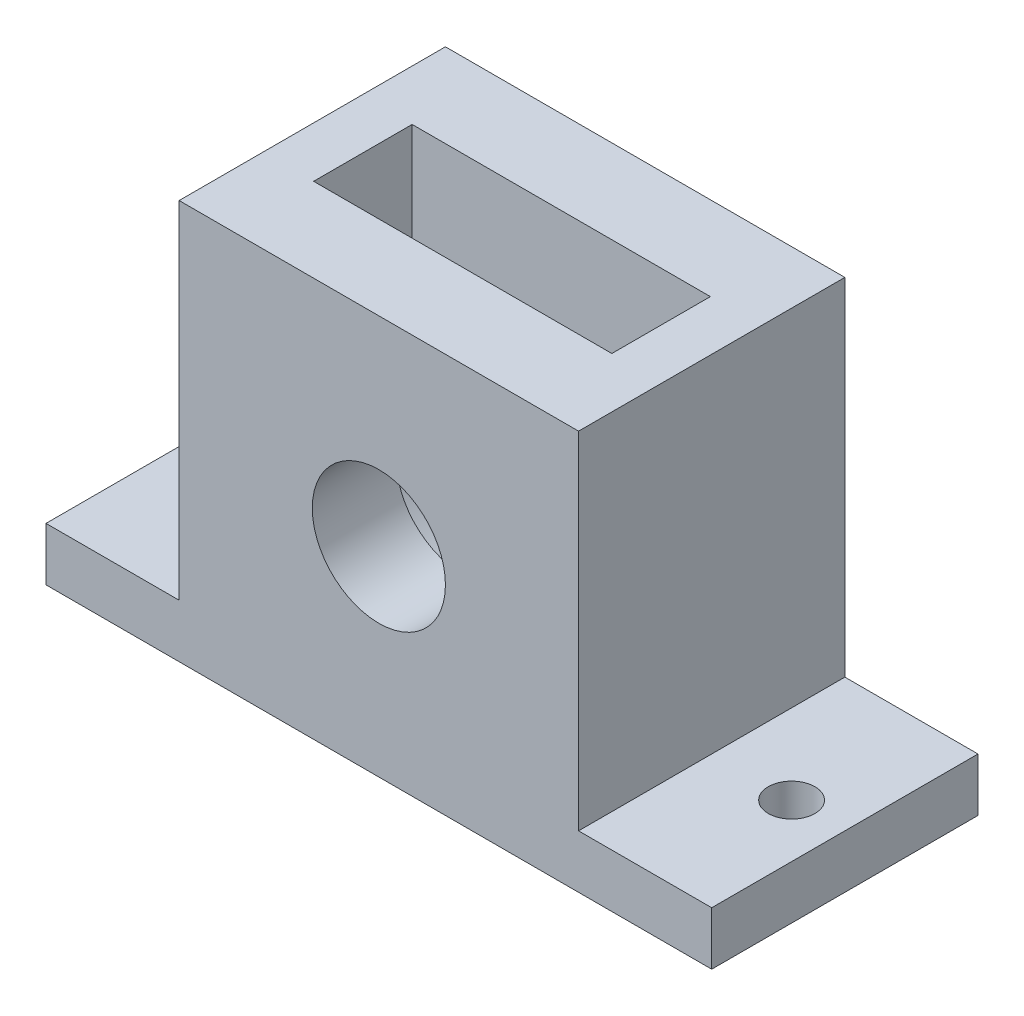
ISO-10303-21;
HEADER;
FILE_DESCRIPTION(('STEP AP214'),'2;1');
FILE_NAME('part.step','',(''),(''),'','','');
FILE_SCHEMA(('AUTOMOTIVE_DESIGN { 1 0 10303 214 1 1 1 1 }'));
ENDSEC;
DATA;
#1=APPLICATION_CONTEXT('core data for automotive mechanical design processes');
#2=APPLICATION_PROTOCOL_DEFINITION('international standard','automotive_design',2000,#1);
#3=PRODUCT_CONTEXT('',#1,'mechanical');
#4=PRODUCT('Part','Part','',(#3));
#5=PRODUCT_RELATED_PRODUCT_CATEGORY('part','',(#4));
#6=PRODUCT_DEFINITION_FORMATION('','',#4);
#7=PRODUCT_DEFINITION_CONTEXT('part definition',#1,'design');
#8=PRODUCT_DEFINITION('design','',#6,#7);
#9=PRODUCT_DEFINITION_SHAPE('','',#8);
#10=(LENGTH_UNIT() NAMED_UNIT(*) SI_UNIT(.MILLI.,.METRE.));
#11=(NAMED_UNIT(*) PLANE_ANGLE_UNIT() SI_UNIT($,.RADIAN.));
#12=(NAMED_UNIT(*) SI_UNIT($,.STERADIAN.) SOLID_ANGLE_UNIT());
#13=UNCERTAINTY_MEASURE_WITH_UNIT(LENGTH_MEASURE(1.E-05),#10,'distance_accuracy_value','');
#14=(GEOMETRIC_REPRESENTATION_CONTEXT(3) GLOBAL_UNCERTAINTY_ASSIGNED_CONTEXT((#13)) GLOBAL_UNIT_ASSIGNED_CONTEXT((#10,
#11,#12)) REPRESENTATION_CONTEXT('',''));
#15=CARTESIAN_POINT('',(0.,0.,0.));
#16=DIRECTION('',(0.,0.,1.));
#17=DIRECTION('',(1.,0.,0.));
#18=AXIS2_PLACEMENT_3D('',#15,#16,#17);
#19=CARTESIAN_POINT('',(15.,-15.,20.));
#20=DIRECTION('',(-1.,0.,0.));
#21=DIRECTION('',(0.,0.,1.));
#22=AXIS2_PLACEMENT_3D('',#19,#20,#21);
#23=PLANE('',#22);
#24=DIRECTION('',(0.,0.,1.));
#25=VECTOR('',#24,1.);
#26=CARTESIAN_POINT('',(15.,-11.,0.));
#27=LINE('',#26,#25);
#28=CARTESIAN_POINT('',(15.,-11.,0.));
#29=VERTEX_POINT('',#28);
#30=CARTESIAN_POINT('',(15.,-11.,20.));
#31=VERTEX_POINT('',#30);
#32=EDGE_CURVE('E62',#29,#31,#27,.T.);
#33=ORIENTED_EDGE('',*,*,#32,.F.);
#34=DIRECTION('',(0.,1.,0.));
#35=VECTOR('',#34,1.);
#36=CARTESIAN_POINT('',(15.,-15.,0.));
#37=LINE('',#36,#35);
#38=CARTESIAN_POINT('',(15.,15.,0.));
#39=VERTEX_POINT('',#38);
#40=EDGE_CURVE('E261',#29,#39,#37,.T.);
#41=ORIENTED_EDGE('',*,*,#40,.T.);
#42=DIRECTION('',(0.,0.,-1.));
#43=VECTOR('',#42,1.);
#44=CARTESIAN_POINT('',(15.,15.,20.));
#45=LINE('',#44,#43);
#46=CARTESIAN_POINT('',(15.,15.,20.));
#47=VERTEX_POINT('',#46);
#48=EDGE_CURVE('E11',#47,#39,#45,.T.);
#49=ORIENTED_EDGE('',*,*,#48,.F.);
#50=DIRECTION('',(0.,1.,0.));
#51=VECTOR('',#50,1.);
#52=CARTESIAN_POINT('',(15.,-15.,20.));
#53=LINE('',#52,#51);
#54=EDGE_CURVE('E266',#31,#47,#53,.T.);
#55=ORIENTED_EDGE('',*,*,#54,.F.);
#56=EDGE_LOOP('',(#33,#41,#49,#55));
#57=FACE_BOUND('',#56,.T.);
#58=ADVANCED_FACE('F45',(#57),#23,.F.);
#59=CARTESIAN_POINT('',(-15.,-15.,20.));
#60=DIRECTION('',(1.,0.,0.));
#61=DIRECTION('',(0.,0.,-1.));
#62=AXIS2_PLACEMENT_3D('',#59,#60,#61);
#63=PLANE('',#62);
#64=DIRECTION('',(0.,0.,-1.));
#65=VECTOR('',#64,1.);
#66=CARTESIAN_POINT('',(-15.,-11.,0.));
#67=LINE('',#66,#65);
#68=CARTESIAN_POINT('',(-15.,-11.,20.));
#69=VERTEX_POINT('',#68);
#70=CARTESIAN_POINT('',(-15.,-11.,0.));
#71=VERTEX_POINT('',#70);
#72=EDGE_CURVE('E70',#69,#71,#67,.T.);
#73=ORIENTED_EDGE('',*,*,#72,.F.);
#74=DIRECTION('',(0.,-1.,0.));
#75=VECTOR('',#74,1.);
#76=CARTESIAN_POINT('',(-15.,-15.,20.));
#77=LINE('',#76,#75);
#78=CARTESIAN_POINT('',(-15.,15.,20.));
#79=VERTEX_POINT('',#78);
#80=EDGE_CURVE('E161',#79,#69,#77,.T.);
#81=ORIENTED_EDGE('',*,*,#80,.F.);
#82=DIRECTION('',(0.,0.,-1.));
#83=VECTOR('',#82,1.);
#84=CARTESIAN_POINT('',(-15.,15.,20.));
#85=LINE('',#84,#83);
#86=CARTESIAN_POINT('',(-15.,15.,0.));
#87=VERTEX_POINT('',#86);
#88=EDGE_CURVE('E54',#79,#87,#85,.T.);
#89=ORIENTED_EDGE('',*,*,#88,.T.);
#90=DIRECTION('',(0.,-1.,0.));
#91=VECTOR('',#90,1.);
#92=CARTESIAN_POINT('',(-15.,-15.,0.));
#93=LINE('',#92,#91);
#94=EDGE_CURVE('E283',#87,#71,#93,.T.);
#95=ORIENTED_EDGE('',*,*,#94,.T.);
#96=EDGE_LOOP('',(#73,#81,#89,#95));
#97=FACE_BOUND('',#96,.T.);
#98=ADVANCED_FACE('F335',(#97),#63,.F.);
#99=CARTESIAN_POINT('',(-15.,15.,20.));
#100=DIRECTION('',(0.,-1.,0.));
#101=DIRECTION('',(0.,0.,-1.));
#102=AXIS2_PLACEMENT_3D('',#99,#100,#101);
#103=PLANE('',#102);
#104=DIRECTION('',(-1.,0.,0.));
#105=VECTOR('',#104,1.);
#106=CARTESIAN_POINT('',(-15.,15.,0.));
#107=LINE('',#106,#105);
#108=EDGE_CURVE('E280',#39,#87,#107,.T.);
#109=ORIENTED_EDGE('',*,*,#108,.T.);
#110=ORIENTED_EDGE('',*,*,#88,.F.);
#111=DIRECTION('',(-1.,0.,0.));
#112=VECTOR('',#111,1.);
#113=CARTESIAN_POINT('',(-15.,15.,20.));
#114=LINE('',#113,#112);
#115=EDGE_CURVE('E269',#47,#79,#114,.T.);
#116=ORIENTED_EDGE('',*,*,#115,.F.);
#117=ORIENTED_EDGE('',*,*,#48,.T.);
#118=EDGE_LOOP('',(#109,#110,#116,#117));
#119=FACE_BOUND('',#118,.T.);
#120=DIRECTION('',(-1.,0.,0.));
#121=VECTOR('',#120,1.);
#122=CARTESIAN_POINT('',(399997.5,14.9999999999864,13.7));
#123=LINE('',#122,#121);
#124=CARTESIAN_POINT('',(11.1999999999739,14.9999999999864,13.7));
#125=VERTEX_POINT('',#124);
#126=CARTESIAN_POINT('',(-11.1999999999508,14.9999999999864,13.7));
#127=VERTEX_POINT('',#126);
#128=EDGE_CURVE('E218',#125,#127,#123,.T.);
#129=ORIENTED_EDGE('',*,*,#128,.T.);
#130=DIRECTION('',(0.,0.,-1.));
#131=VECTOR('',#130,1.);
#132=CARTESIAN_POINT('',(-11.1999999999508,14.9999999999864,13.7));
#133=LINE('',#132,#131);
#134=CARTESIAN_POINT('',(-11.1999999999508,14.9999999999864,6.3));
#135=VERTEX_POINT('',#134);
#136=EDGE_CURVE('E248',#127,#135,#133,.T.);
#137=ORIENTED_EDGE('',*,*,#136,.T.);
#138=DIRECTION('',(-1.,0.,0.));
#139=VECTOR('',#138,1.);
#140=CARTESIAN_POINT('',(399997.5,14.9999999999864,6.3));
#141=LINE('',#140,#139);
#142=CARTESIAN_POINT('',(11.2,15.,6.3));
#143=VERTEX_POINT('',#142);
#144=EDGE_CURVE('E233',#143,#135,#141,.T.);
#145=ORIENTED_EDGE('',*,*,#144,.F.);
#146=DIRECTION('',(0.,0.,-1.));
#147=VECTOR('',#146,1.);
#148=CARTESIAN_POINT('',(11.1999999999739,14.9999999999864,13.7));
#149=LINE('',#148,#147);
#150=EDGE_CURVE('E252',#125,#143,#149,.T.);
#151=ORIENTED_EDGE('',*,*,#150,.F.);
#152=EDGE_LOOP('',(#129,#137,#145,#151));
#153=FACE_BOUND('',#152,.T.);
#154=ADVANCED_FACE('F321',(#119,#153),#103,.F.);
#155=CARTESIAN_POINT('',(0.,0.,20.));
#156=DIRECTION('',(0.,0.,-1.));
#157=DIRECTION('',(-1.,0.,0.));
#158=AXIS2_PLACEMENT_3D('',#155,#156,#157);
#159=CYLINDRICAL_SURFACE('',#158,5.);
#160=CARTESIAN_POINT('',(0.,0.,20.));
#161=DIRECTION('',(0.,0.,1.));
#162=DIRECTION('',(1.,0.,0.));
#163=AXIS2_PLACEMENT_3D('',#160,#161,#162);
#164=CIRCLE('',#163,5.);
#165=CARTESIAN_POINT('',(5.,0.,20.));
#166=VERTEX_POINT('',#165);
#167=EDGE_CURVE('E257',#166,#166,#164,.T.);
#168=ORIENTED_EDGE('',*,*,#167,.T.);
#169=EDGE_LOOP('',(#168));
#170=FACE_BOUND('',#169,.T.);
#171=CARTESIAN_POINT('',(0.,0.,13.7));
#172=DIRECTION('',(0.,0.,-1.));
#173=DIRECTION('',(-1.,0.,0.));
#174=AXIS2_PLACEMENT_3D('',#171,#172,#173);
#175=CIRCLE('',#174,5.);
#176=CARTESIAN_POINT('',(-5.,0.,13.7));
#177=VERTEX_POINT('',#176);
#178=EDGE_CURVE('E48',#177,#177,#175,.T.);
#179=ORIENTED_EDGE('',*,*,#178,.T.);
#180=EDGE_LOOP('',(#179));
#181=FACE_BOUND('',#180,.T.);
#182=ADVANCED_FACE('F298',(#170,#181),#159,.F.);
#183=CARTESIAN_POINT('',(0.,0.,20.));
#184=DIRECTION('',(0.,0.,-1.));
#185=DIRECTION('',(-1.,0.,0.));
#186=AXIS2_PLACEMENT_3D('',#183,#184,#185);
#187=PLANE('',#186);
#188=DIRECTION('',(1.,0.,0.));
#189=VECTOR('',#188,1.);
#190=CARTESIAN_POINT('',(-15.,-15.,20.));
#191=LINE('',#190,#189);
#192=CARTESIAN_POINT('',(-25.,-15.,20.));
#193=VERTEX_POINT('',#192);
#194=CARTESIAN_POINT('',(25.,-15.,20.));
#195=VERTEX_POINT('',#194);
#196=EDGE_CURVE('E275',#193,#195,#191,.T.);
#197=ORIENTED_EDGE('',*,*,#196,.T.);
#198=DIRECTION('',(0.,-1.,0.));
#199=VECTOR('',#198,1.);
#200=CARTESIAN_POINT('',(25.,-11.,20.));
#201=LINE('',#200,#199);
#202=CARTESIAN_POINT('',(25.,-11.,20.));
#203=VERTEX_POINT('',#202);
#204=EDGE_CURVE('E200',#203,#195,#201,.T.);
#205=ORIENTED_EDGE('',*,*,#204,.F.);
#206=DIRECTION('',(1.,0.,0.));
#207=VECTOR('',#206,1.);
#208=CARTESIAN_POINT('',(0.,-11.,20.));
#209=LINE('',#208,#207);
#210=EDGE_CURVE('E191',#31,#203,#209,.T.);
#211=ORIENTED_EDGE('',*,*,#210,.F.);
#212=ORIENTED_EDGE('',*,*,#54,.T.);
#213=ORIENTED_EDGE('',*,*,#115,.T.);
#214=ORIENTED_EDGE('',*,*,#80,.T.);
#215=DIRECTION('',(-1.,0.,0.));
#216=VECTOR('',#215,1.);
#217=CARTESIAN_POINT('',(0.,-11.,20.));
#218=LINE('',#217,#216);
#219=CARTESIAN_POINT('',(-25.,-11.,20.));
#220=VERTEX_POINT('',#219);
#221=EDGE_CURVE('E153',#69,#220,#218,.T.);
#222=ORIENTED_EDGE('',*,*,#221,.T.);
#223=DIRECTION('',(0.,-1.,0.));
#224=VECTOR('',#223,1.);
#225=CARTESIAN_POINT('',(-25.,-11.,20.));
#226=LINE('',#225,#224);
#227=EDGE_CURVE('E138',#220,#193,#226,.T.);
#228=ORIENTED_EDGE('',*,*,#227,.T.);
#229=EDGE_LOOP('',(#197,#205,#211,#212,#213,#214,#222,#228));
#230=FACE_BOUND('',#229,.T.);
#231=ORIENTED_EDGE('',*,*,#167,.F.);
#232=EDGE_LOOP('',(#231));
#233=FACE_BOUND('',#232,.T.);
#234=ADVANCED_FACE('F159',(#230,#233),#187,.F.);
#235=CARTESIAN_POINT('',(0.,0.,0.));
#236=DIRECTION('',(0.,0.,-1.));
#237=DIRECTION('',(-1.,0.,0.));
#238=AXIS2_PLACEMENT_3D('',#235,#236,#237);
#239=PLANE('',#238);
#240=ORIENTED_EDGE('',*,*,#40,.F.);
#241=DIRECTION('',(1.,0.,0.));
#242=VECTOR('',#241,1.);
#243=CARTESIAN_POINT('',(0.,-11.,0.));
#244=LINE('',#243,#242);
#245=CARTESIAN_POINT('',(25.,-11.,0.));
#246=VERTEX_POINT('',#245);
#247=EDGE_CURVE('E196',#29,#246,#244,.T.);
#248=ORIENTED_EDGE('',*,*,#247,.T.);
#249=DIRECTION('',(0.,-1.,0.));
#250=VECTOR('',#249,1.);
#251=CARTESIAN_POINT('',(25.,-11.,0.));
#252=LINE('',#251,#250);
#253=CARTESIAN_POINT('',(25.,-15.,0.));
#254=VERTEX_POINT('',#253);
#255=EDGE_CURVE('E177',#246,#254,#252,.T.);
#256=ORIENTED_EDGE('',*,*,#255,.T.);
#257=DIRECTION('',(1.,0.,0.));
#258=VECTOR('',#257,1.);
#259=CARTESIAN_POINT('',(-15.,-15.,0.));
#260=LINE('',#259,#258);
#261=CARTESIAN_POINT('',(-25.,-15.,0.));
#262=VERTEX_POINT('',#261);
#263=EDGE_CURVE('E270',#262,#254,#260,.T.);
#264=ORIENTED_EDGE('',*,*,#263,.F.);
#265=DIRECTION('',(0.,-1.,0.));
#266=VECTOR('',#265,1.);
#267=CARTESIAN_POINT('',(-25.,-11.,0.));
#268=LINE('',#267,#266);
#269=CARTESIAN_POINT('',(-25.,-11.,0.));
#270=VERTEX_POINT('',#269);
#271=EDGE_CURVE('E148',#270,#262,#268,.T.);
#272=ORIENTED_EDGE('',*,*,#271,.F.);
#273=DIRECTION('',(-1.,0.,0.));
#274=VECTOR('',#273,1.);
#275=CARTESIAN_POINT('',(0.,-11.,0.));
#276=LINE('',#275,#274);
#277=EDGE_CURVE('E155',#71,#270,#276,.T.);
#278=ORIENTED_EDGE('',*,*,#277,.F.);
#279=ORIENTED_EDGE('',*,*,#94,.F.);
#280=ORIENTED_EDGE('',*,*,#108,.F.);
#281=EDGE_LOOP('',(#240,#248,#256,#264,#272,#278,#279,#280));
#282=FACE_BOUND('',#281,.T.);
#283=CARTESIAN_POINT('',(0.,0.,0.));
#284=DIRECTION('',(0.,0.,1.));
#285=DIRECTION('',(1.,0.,0.));
#286=AXIS2_PLACEMENT_3D('',#283,#284,#285);
#287=CIRCLE('',#286,5.);
#288=CARTESIAN_POINT('',(5.,0.,0.));
#289=VERTEX_POINT('',#288);
#290=EDGE_CURVE('E262',#289,#289,#287,.T.);
#291=ORIENTED_EDGE('',*,*,#290,.T.);
#292=EDGE_LOOP('',(#291));
#293=FACE_BOUND('',#292,.T.);
#294=ADVANCED_FACE('F349',(#282,#293),#239,.T.);
#295=CARTESIAN_POINT('',(-15.,-15.,20.));
#296=DIRECTION('',(0.,1.,0.));
#297=DIRECTION('',(0.,0.,1.));
#298=AXIS2_PLACEMENT_3D('',#295,#296,#297);
#299=PLANE('',#298);
#300=ORIENTED_EDGE('',*,*,#263,.T.);
#301=DIRECTION('',(0.,0.,-1.));
#302=VECTOR('',#301,1.);
#303=CARTESIAN_POINT('',(25.,-15.,0.));
#304=LINE('',#303,#302);
#305=EDGE_CURVE('E188',#195,#254,#304,.T.);
#306=ORIENTED_EDGE('',*,*,#305,.F.);
#307=ORIENTED_EDGE('',*,*,#196,.F.);
#308=DIRECTION('',(0.,0.,-1.));
#309=VECTOR('',#308,1.);
#310=CARTESIAN_POINT('',(-25.,-15.,0.));
#311=LINE('',#310,#309);
#312=EDGE_CURVE('E144',#193,#262,#311,.T.);
#313=ORIENTED_EDGE('',*,*,#312,.T.);
#314=EDGE_LOOP('',(#300,#306,#307,#313));
#315=FACE_BOUND('',#314,.T.);
#316=CARTESIAN_POINT('',(-21.,-15.,10.));
#317=DIRECTION('',(0.,-1.,0.));
#318=DIRECTION('',(0.,0.,-1.));
#319=AXIS2_PLACEMENT_3D('',#316,#317,#318);
#320=CIRCLE('',#319,1.75);
#321=CARTESIAN_POINT('',(-21.,-15.,8.25));
#322=VERTEX_POINT('',#321);
#323=EDGE_CURVE('E173',#322,#322,#320,.T.);
#324=ORIENTED_EDGE('',*,*,#323,.F.);
#325=EDGE_LOOP('',(#324));
#326=FACE_BOUND('',#325,.T.);
#327=CARTESIAN_POINT('',(21.,-15.,10.));
#328=DIRECTION('',(0.,-1.,0.));
#329=DIRECTION('',(0.,0.,-1.));
#330=AXIS2_PLACEMENT_3D('',#327,#328,#329);
#331=CIRCLE('',#330,1.75);
#332=CARTESIAN_POINT('',(21.,-15.,8.25000000000001));
#333=VERTEX_POINT('',#332);
#334=EDGE_CURVE('E201',#333,#333,#331,.T.);
#335=ORIENTED_EDGE('',*,*,#334,.F.);
#336=EDGE_LOOP('',(#335));
#337=FACE_BOUND('',#336,.T.);
#338=ADVANCED_FACE('F331',(#315,#326,#337),#299,.F.);
#339=CARTESIAN_POINT('',(0.,0.,6.3));
#340=DIRECTION('',(0.,0.,-1.));
#341=DIRECTION('',(-1.,0.,0.));
#342=AXIS2_PLACEMENT_3D('',#339,#340,#341);
#343=CIRCLE('',#342,5.);
#344=CARTESIAN_POINT('',(-5.,0.,6.3));
#345=VERTEX_POINT('',#344);
#346=EDGE_CURVE('E256',#345,#345,#343,.T.);
#347=ORIENTED_EDGE('',*,*,#346,.F.);
#348=EDGE_LOOP('',(#347));
#349=FACE_BOUND('',#348,.T.);
#350=ORIENTED_EDGE('',*,*,#290,.F.);
#351=EDGE_LOOP('',(#350));
#352=FACE_BOUND('',#351,.T.);
#353=ADVANCED_FACE('F324',(#349,#352),#159,.F.);
#354=CARTESIAN_POINT('',(11.1999999999171,-291580.75,13.7));
#355=DIRECTION('',(-1.,0.,0.));
#356=DIRECTION('',(0.,-1.,0.));
#357=AXIS2_PLACEMENT_3D('',#354,#355,#356);
#358=PLANE('',#357);
#359=DIRECTION('',(0.,1.,0.));
#360=VECTOR('',#359,1.);
#361=CARTESIAN_POINT('',(11.1999999999171,-291580.75,6.3));
#362=LINE('',#361,#360);
#363=CARTESIAN_POINT('',(11.2,0.,6.3));
#364=VERTEX_POINT('',#363);
#365=EDGE_CURVE('E181',#364,#143,#362,.T.);
#366=ORIENTED_EDGE('',*,*,#365,.F.);
#367=DIRECTION('',(0.,0.,-1.));
#368=VECTOR('',#367,1.);
#369=CARTESIAN_POINT('',(11.2,0.,13.7));
#370=LINE('',#369,#368);
#371=CARTESIAN_POINT('',(11.2,0.,13.7));
#372=VERTEX_POINT('',#371);
#373=EDGE_CURVE('E230',#372,#364,#370,.T.);
#374=ORIENTED_EDGE('',*,*,#373,.F.);
#375=DIRECTION('',(0.,1.,0.));
#376=VECTOR('',#375,1.);
#377=CARTESIAN_POINT('',(11.1999999999171,-291580.75,13.7));
#378=LINE('',#377,#376);
#379=EDGE_CURVE('E214',#372,#125,#378,.T.);
#380=ORIENTED_EDGE('',*,*,#379,.T.);
#381=ORIENTED_EDGE('',*,*,#150,.T.);
#382=EDGE_LOOP('',(#366,#374,#380,#381));
#383=FACE_BOUND('',#382,.T.);
#384=ADVANCED_FACE('F322',(#383),#358,.T.);
#385=CARTESIAN_POINT('',(-11.1999999999171,-291580.75,13.7));
#386=DIRECTION('',(1.,0.,0.));
#387=DIRECTION('',(0.,1.,0.));
#388=AXIS2_PLACEMENT_3D('',#385,#386,#387);
#389=PLANE('',#388);
#390=DIRECTION('',(0.,-1.,0.));
#391=VECTOR('',#390,1.);
#392=CARTESIAN_POINT('',(-11.1999999999171,-291580.75,6.3));
#393=LINE('',#392,#391);
#394=CARTESIAN_POINT('',(-11.2,0.,6.3));
#395=VERTEX_POINT('',#394);
#396=EDGE_CURVE('E236',#135,#395,#393,.T.);
#397=ORIENTED_EDGE('',*,*,#396,.F.);
#398=ORIENTED_EDGE('',*,*,#136,.F.);
#399=DIRECTION('',(0.,-1.,0.));
#400=VECTOR('',#399,1.);
#401=CARTESIAN_POINT('',(-11.1999999999171,-291580.75,13.7));
#402=LINE('',#401,#400);
#403=CARTESIAN_POINT('',(-11.2,0.,13.7));
#404=VERTEX_POINT('',#403);
#405=EDGE_CURVE('E223',#127,#404,#402,.T.);
#406=ORIENTED_EDGE('',*,*,#405,.T.);
#407=DIRECTION('',(0.,0.,-1.));
#408=VECTOR('',#407,1.);
#409=CARTESIAN_POINT('',(-11.2,0.,13.7));
#410=LINE('',#409,#408);
#411=EDGE_CURVE('E245',#404,#395,#410,.T.);
#412=ORIENTED_EDGE('',*,*,#411,.T.);
#413=EDGE_LOOP('',(#397,#398,#406,#412));
#414=FACE_BOUND('',#413,.T.);
#415=ADVANCED_FACE('F317',(#414),#389,.T.);
#416=CARTESIAN_POINT('',(0.,0.,13.7));
#417=DIRECTION('',(0.,0.,-1.));
#418=DIRECTION('',(-1.,0.,0.));
#419=AXIS2_PLACEMENT_3D('',#416,#417,#418);
#420=CYLINDRICAL_SURFACE('',#419,11.2);
#421=CARTESIAN_POINT('',(0.,0.,6.3));
#422=DIRECTION('',(0.,0.,-1.));
#423=DIRECTION('',(-1.,0.,0.));
#424=AXIS2_PLACEMENT_3D('',#421,#422,#423);
#425=CIRCLE('',#424,11.2);
#426=EDGE_CURVE('E219',#364,#395,#425,.T.);
#427=ORIENTED_EDGE('',*,*,#426,.T.);
#428=ORIENTED_EDGE('',*,*,#411,.F.);
#429=CARTESIAN_POINT('',(0.,0.,13.7));
#430=DIRECTION('',(0.,0.,-1.));
#431=DIRECTION('',(-1.,0.,0.));
#432=AXIS2_PLACEMENT_3D('',#429,#430,#431);
#433=CIRCLE('',#432,11.2);
#434=EDGE_CURVE('E226',#372,#404,#433,.T.);
#435=ORIENTED_EDGE('',*,*,#434,.F.);
#436=ORIENTED_EDGE('',*,*,#373,.T.);
#437=EDGE_LOOP('',(#427,#428,#435,#436));
#438=FACE_BOUND('',#437,.T.);
#439=ADVANCED_FACE('F304',(#438),#420,.F.);
#440=CARTESIAN_POINT('',(0.,0.,13.7));
#441=DIRECTION('',(0.,0.,-1.));
#442=DIRECTION('',(-1.,0.,0.));
#443=AXIS2_PLACEMENT_3D('',#440,#441,#442);
#444=PLANE('',#443);
#445=ORIENTED_EDGE('',*,*,#178,.F.);
#446=EDGE_LOOP('',(#445));
#447=FACE_BOUND('',#446,.T.);
#448=ORIENTED_EDGE('',*,*,#379,.F.);
#449=ORIENTED_EDGE('',*,*,#434,.T.);
#450=ORIENTED_EDGE('',*,*,#405,.F.);
#451=ORIENTED_EDGE('',*,*,#128,.F.);
#452=EDGE_LOOP('',(#448,#449,#450,#451));
#453=FACE_BOUND('',#452,.T.);
#454=ADVANCED_FACE('F300',(#447,#453),#444,.T.);
#455=CARTESIAN_POINT('',(0.,0.,6.3));
#456=DIRECTION('',(0.,0.,-1.));
#457=DIRECTION('',(-1.,0.,0.));
#458=AXIS2_PLACEMENT_3D('',#455,#456,#457);
#459=PLANE('',#458);
#460=ORIENTED_EDGE('',*,*,#346,.T.);
#461=EDGE_LOOP('',(#460));
#462=FACE_BOUND('',#461,.T.);
#463=ORIENTED_EDGE('',*,*,#365,.T.);
#464=ORIENTED_EDGE('',*,*,#144,.T.);
#465=ORIENTED_EDGE('',*,*,#396,.T.);
#466=ORIENTED_EDGE('',*,*,#426,.F.);
#467=EDGE_LOOP('',(#463,#464,#465,#466));
#468=FACE_BOUND('',#467,.T.);
#469=ADVANCED_FACE('F303',(#462,#468),#459,.F.);
#470=CARTESIAN_POINT('',(-21.,-11.,10.));
#471=DIRECTION('',(0.,-1.,0.));
#472=DIRECTION('',(0.,0.,-1.));
#473=AXIS2_PLACEMENT_3D('',#470,#471,#472);
#474=CYLINDRICAL_SURFACE('',#473,1.75);
#475=CARTESIAN_POINT('',(-21.,-11.,10.));
#476=DIRECTION('',(0.,-1.,0.));
#477=DIRECTION('',(0.,0.,-1.));
#478=AXIS2_PLACEMENT_3D('',#475,#476,#477);
#479=CIRCLE('',#478,1.75);
#480=CARTESIAN_POINT('',(-21.,-11.,8.25));
#481=VERTEX_POINT('',#480);
#482=EDGE_CURVE('E163',#481,#481,#479,.T.);
#483=ORIENTED_EDGE('',*,*,#482,.F.);
#484=EDGE_LOOP('',(#483));
#485=FACE_BOUND('',#484,.T.);
#486=ORIENTED_EDGE('',*,*,#323,.T.);
#487=EDGE_LOOP('',(#486));
#488=FACE_BOUND('',#487,.T.);
#489=ADVANCED_FACE('F415',(#485,#488),#474,.F.);
#490=CARTESIAN_POINT('',(-25.,-11.,0.));
#491=DIRECTION('',(-1.,0.,0.));
#492=DIRECTION('',(0.,0.,1.));
#493=AXIS2_PLACEMENT_3D('',#490,#491,#492);
#494=PLANE('',#493);
#495=ORIENTED_EDGE('',*,*,#312,.F.);
#496=ORIENTED_EDGE('',*,*,#227,.F.);
#497=DIRECTION('',(0.,0.,-1.));
#498=VECTOR('',#497,1.);
#499=CARTESIAN_POINT('',(-25.,-11.,0.));
#500=LINE('',#499,#498);
#501=EDGE_CURVE('E142',#220,#270,#500,.T.);
#502=ORIENTED_EDGE('',*,*,#501,.T.);
#503=ORIENTED_EDGE('',*,*,#271,.T.);
#504=EDGE_LOOP('',(#495,#496,#502,#503));
#505=FACE_BOUND('',#504,.T.);
#506=ADVANCED_FACE('F140',(#505),#494,.T.);
#507=CARTESIAN_POINT('',(0.,-11.,0.));
#508=DIRECTION('',(0.,-1.,0.));
#509=DIRECTION('',(0.,0.,-1.));
#510=AXIS2_PLACEMENT_3D('',#507,#508,#509);
#511=PLANE('',#510);
#512=ORIENTED_EDGE('',*,*,#482,.T.);
#513=EDGE_LOOP('',(#512));
#514=FACE_BOUND('',#513,.T.);
#515=ORIENTED_EDGE('',*,*,#221,.F.);
#516=ORIENTED_EDGE('',*,*,#72,.T.);
#517=ORIENTED_EDGE('',*,*,#277,.T.);
#518=ORIENTED_EDGE('',*,*,#501,.F.);
#519=EDGE_LOOP('',(#515,#516,#517,#518));
#520=FACE_BOUND('',#519,.T.);
#521=ADVANCED_FACE('F152',(#514,#520),#511,.F.);
#522=CARTESIAN_POINT('',(25.,-11.,0.));
#523=DIRECTION('',(-1.,0.,0.));
#524=DIRECTION('',(0.,0.,1.));
#525=AXIS2_PLACEMENT_3D('',#522,#523,#524);
#526=PLANE('',#525);
#527=ORIENTED_EDGE('',*,*,#305,.T.);
#528=ORIENTED_EDGE('',*,*,#255,.F.);
#529=DIRECTION('',(0.,0.,-1.));
#530=VECTOR('',#529,1.);
#531=CARTESIAN_POINT('',(25.,-11.,0.));
#532=LINE('',#531,#530);
#533=EDGE_CURVE('E187',#203,#246,#532,.T.);
#534=ORIENTED_EDGE('',*,*,#533,.F.);
#535=ORIENTED_EDGE('',*,*,#204,.T.);
#536=EDGE_LOOP('',(#527,#528,#534,#535));
#537=FACE_BOUND('',#536,.T.);
#538=ADVANCED_FACE('F451',(#537),#526,.F.);
#539=CARTESIAN_POINT('',(21.,-11.,10.));
#540=DIRECTION('',(0.,-1.,0.));
#541=DIRECTION('',(0.,0.,-1.));
#542=AXIS2_PLACEMENT_3D('',#539,#540,#541);
#543=CYLINDRICAL_SURFACE('',#542,1.75);
#544=CARTESIAN_POINT('',(21.,-11.,10.));
#545=DIRECTION('',(0.,-1.,0.));
#546=DIRECTION('',(0.,0.,-1.));
#547=AXIS2_PLACEMENT_3D('',#544,#545,#546);
#548=CIRCLE('',#547,1.75);
#549=CARTESIAN_POINT('',(21.,-11.,8.25000000000001));
#550=VERTEX_POINT('',#549);
#551=EDGE_CURVE('E183',#550,#550,#548,.T.);
#552=ORIENTED_EDGE('',*,*,#551,.F.);
#553=EDGE_LOOP('',(#552));
#554=FACE_BOUND('',#553,.T.);
#555=ORIENTED_EDGE('',*,*,#334,.T.);
#556=EDGE_LOOP('',(#555));
#557=FACE_BOUND('',#556,.T.);
#558=ADVANCED_FACE('F447',(#554,#557),#543,.F.);
#559=CARTESIAN_POINT('',(0.,-11.,0.));
#560=DIRECTION('',(0.,-1.,0.));
#561=DIRECTION('',(0.,0.,-1.));
#562=AXIS2_PLACEMENT_3D('',#559,#560,#561);
#563=PLANE('',#562);
#564=ORIENTED_EDGE('',*,*,#551,.T.);
#565=EDGE_LOOP('',(#564));
#566=FACE_BOUND('',#565,.T.);
#567=ORIENTED_EDGE('',*,*,#533,.T.);
#568=ORIENTED_EDGE('',*,*,#247,.F.);
#569=ORIENTED_EDGE('',*,*,#32,.T.);
#570=ORIENTED_EDGE('',*,*,#210,.T.);
#571=EDGE_LOOP('',(#567,#568,#569,#570));
#572=FACE_BOUND('',#571,.T.);
#573=ADVANCED_FACE('F450',(#566,#572),#563,.F.);
#574=CLOSED_SHELL('',(#58,#98,#154,#182,#234,#294,#338,#353,#384,#415,#439,#454,#469,#489,#506,
#521,#538,#558,#573));
#575=MANIFOLD_SOLID_BREP('B2',#574);
#576=ADVANCED_BREP_SHAPE_REPRESENTATION('',(#18,#575),#14);
#577=SHAPE_DEFINITION_REPRESENTATION(#9,#576);
ENDSEC;
END-ISO-10303-21;
